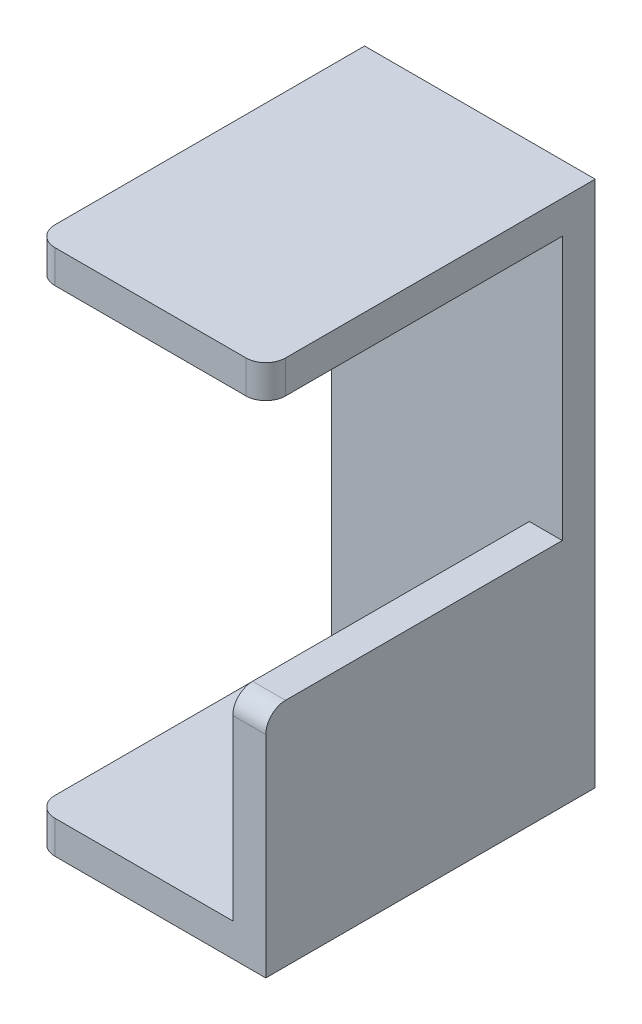
ISO-10303-21;
HEADER;
FILE_DESCRIPTION(('STEP AP214'),'2;1');
FILE_NAME('part.step','',(''),(''),'','','');
FILE_SCHEMA(('AUTOMOTIVE_DESIGN { 1 0 10303 214 1 1 1 1 }'));
ENDSEC;
DATA;
#1=APPLICATION_CONTEXT('core data for automotive mechanical design processes');
#2=APPLICATION_PROTOCOL_DEFINITION('international standard','automotive_design',2000,#1);
#3=PRODUCT_CONTEXT('',#1,'mechanical');
#4=PRODUCT('Part','Part','',(#3));
#5=PRODUCT_RELATED_PRODUCT_CATEGORY('part','',(#4));
#6=PRODUCT_DEFINITION_FORMATION('','',#4);
#7=PRODUCT_DEFINITION_CONTEXT('part definition',#1,'design');
#8=PRODUCT_DEFINITION('design','',#6,#7);
#9=PRODUCT_DEFINITION_SHAPE('','',#8);
#10=(LENGTH_UNIT() NAMED_UNIT(*) SI_UNIT(.MILLI.,.METRE.));
#11=(NAMED_UNIT(*) PLANE_ANGLE_UNIT() SI_UNIT($,.RADIAN.));
#12=(NAMED_UNIT(*) SI_UNIT($,.STERADIAN.) SOLID_ANGLE_UNIT());
#13=UNCERTAINTY_MEASURE_WITH_UNIT(LENGTH_MEASURE(1.E-05),#10,'distance_accuracy_value','');
#14=(GEOMETRIC_REPRESENTATION_CONTEXT(3) GLOBAL_UNCERTAINTY_ASSIGNED_CONTEXT((#13)) GLOBAL_UNIT_ASSIGNED_CONTEXT((#10,
#11,#12)) REPRESENTATION_CONTEXT('',''));
#15=CARTESIAN_POINT('',(0.,0.,0.));
#16=DIRECTION('',(0.,0.,1.));
#17=DIRECTION('',(1.,0.,0.));
#18=AXIS2_PLACEMENT_3D('',#15,#16,#17);
#19=CARTESIAN_POINT('',(0.,0.,5.));
#20=DIRECTION('',(0.,0.,1.));
#21=DIRECTION('',(1.,0.,0.));
#22=AXIS2_PLACEMENT_3D('',#19,#20,#21);
#23=PLANE('',#22);
#24=DIRECTION('',(0.,1.,0.));
#25=VECTOR('',#24,1.);
#26=CARTESIAN_POINT('',(-17.1381771381771,-45.1948051948052,5.));
#27=LINE('',#26,#25);
#28=CARTESIAN_POINT('',(-17.1381771381771,-40.1948051948052,5.));
#29=VERTEX_POINT('',#28);
#30=CARTESIAN_POINT('',(-17.1381771381771,-10.1948051948052,5.));
#31=VERTEX_POINT('',#30);
#32=EDGE_CURVE('E185',#29,#31,#27,.T.);
#33=ORIENTED_EDGE('',*,*,#32,.T.);
#34=DIRECTION('',(-1.,0.,0.));
#35=VECTOR('',#34,1.);
#36=CARTESIAN_POINT('',(-12.1381771381771,-10.1948051948052,5.));
#37=LINE('',#36,#35);
#38=CARTESIAN_POINT('',(-12.1381771381771,-10.1948051948052,5.));
#39=VERTEX_POINT('',#38);
#40=EDGE_CURVE('E199',#39,#31,#37,.T.);
#41=ORIENTED_EDGE('',*,*,#40,.F.);
#42=DIRECTION('',(0.,1.,0.));
#43=VECTOR('',#42,1.);
#44=CARTESIAN_POINT('',(-12.1381771381771,34.8051948051948,5.));
#45=LINE('',#44,#43);
#46=CARTESIAN_POINT('',(-12.1381771381771,29.8051948051948,5.));
#47=VERTEX_POINT('',#46);
#48=EDGE_CURVE('E226',#39,#47,#45,.T.);
#49=ORIENTED_EDGE('',*,*,#48,.T.);
#50=DIRECTION('',(1.,0.,0.));
#51=VECTOR('',#50,1.);
#52=CARTESIAN_POINT('',(-47.1381771381771,29.8051948051948,5.));
#53=LINE('',#52,#51);
#54=CARTESIAN_POINT('',(-47.1381771381771,29.8051948051948,5.));
#55=VERTEX_POINT('',#54);
#56=EDGE_CURVE('E209',#55,#47,#53,.T.);
#57=ORIENTED_EDGE('',*,*,#56,.F.);
#58=DIRECTION('',(0.,-1.,0.));
#59=VECTOR('',#58,1.);
#60=CARTESIAN_POINT('',(-47.1381771381771,34.8051948051948,5.));
#61=LINE('',#60,#59);
#62=CARTESIAN_POINT('',(-47.1381771381771,-40.1948051948052,5.));
#63=VERTEX_POINT('',#62);
#64=EDGE_CURVE('E222',#55,#63,#61,.T.);
#65=ORIENTED_EDGE('',*,*,#64,.T.);
#66=DIRECTION('',(1.,0.,0.));
#67=VECTOR('',#66,1.);
#68=CARTESIAN_POINT('',(-47.1381771381771,-40.1948051948052,5.));
#69=LINE('',#68,#67);
#70=EDGE_CURVE('E177',#63,#29,#69,.T.);
#71=ORIENTED_EDGE('',*,*,#70,.T.);
#72=EDGE_LOOP('',(#33,#41,#49,#57,#65,#71));
#73=FACE_BOUND('',#72,.T.);
#74=ADVANCED_FACE('F63',(#73),#23,.T.);
#75=CARTESIAN_POINT('',(-47.1381771381771,34.8051948051948,5.));
#76=DIRECTION('',(1.,0.,0.));
#77=DIRECTION('',(0.,0.,-1.));
#78=AXIS2_PLACEMENT_3D('',#75,#76,#77);
#79=PLANE('',#78);
#80=DIRECTION('',(0.,0.,-1.));
#81=VECTOR('',#80,1.);
#82=CARTESIAN_POINT('',(-47.1381771381771,-45.1948051948052,5.));
#83=LINE('',#82,#81);
#84=CARTESIAN_POINT('',(-47.1381771381771,-45.1948051948052,47.));
#85=VERTEX_POINT('',#84);
#86=CARTESIAN_POINT('',(-47.1381771381771,-45.1948051948052,0.));
#87=VERTEX_POINT('',#86);
#88=EDGE_CURVE('E254',#85,#87,#83,.T.);
#89=ORIENTED_EDGE('',*,*,#88,.F.);
#90=DIRECTION('',(0.,1.,0.));
#91=VECTOR('',#90,1.);
#92=CARTESIAN_POINT('',(-47.1381771381771,34.8051948051948,47.));
#93=LINE('',#92,#91);
#94=CARTESIAN_POINT('',(-47.1381771381771,-40.1948051948052,47.));
#95=VERTEX_POINT('',#94);
#96=EDGE_CURVE('E260',#85,#95,#93,.T.);
#97=ORIENTED_EDGE('',*,*,#96,.T.);
#98=DIRECTION('',(0.,0.,-1.));
#99=VECTOR('',#98,1.);
#100=CARTESIAN_POINT('',(-47.1381771381771,-40.1948051948052,50.));
#101=LINE('',#100,#99);
#102=EDGE_CURVE('E324',#95,#63,#101,.T.);
#103=ORIENTED_EDGE('',*,*,#102,.T.);
#104=ORIENTED_EDGE('',*,*,#64,.F.);
#105=DIRECTION('',(0.,0.,-1.));
#106=VECTOR('',#105,1.);
#107=CARTESIAN_POINT('',(-47.1381771381771,29.8051948051948,50.));
#108=LINE('',#107,#106);
#109=CARTESIAN_POINT('',(-47.1381771381771,29.8051948051948,47.));
#110=VERTEX_POINT('',#109);
#111=EDGE_CURVE('E212',#110,#55,#108,.T.);
#112=ORIENTED_EDGE('',*,*,#111,.F.);
#113=DIRECTION('',(0.,-1.,0.));
#114=VECTOR('',#113,1.);
#115=CARTESIAN_POINT('',(-47.1381771381771,34.8051948051948,47.));
#116=LINE('',#115,#114);
#117=CARTESIAN_POINT('',(-47.1381771381771,34.8051948051948,47.));
#118=VERTEX_POINT('',#117);
#119=EDGE_CURVE('E257',#110,#118,#116,.F.);
#120=ORIENTED_EDGE('',*,*,#119,.T.);
#121=DIRECTION('',(0.,0.,-1.));
#122=VECTOR('',#121,1.);
#123=CARTESIAN_POINT('',(-47.1381771381771,34.8051948051948,5.));
#124=LINE('',#123,#122);
#125=CARTESIAN_POINT('',(-47.1381771381771,34.8051948051948,0.));
#126=VERTEX_POINT('',#125);
#127=EDGE_CURVE('E231',#118,#126,#124,.T.);
#128=ORIENTED_EDGE('',*,*,#127,.T.);
#129=DIRECTION('',(0.,-1.,0.));
#130=VECTOR('',#129,1.);
#131=CARTESIAN_POINT('',(-47.1381771381771,34.8051948051948,0.));
#132=LINE('',#131,#130);
#133=EDGE_CURVE('E221',#126,#87,#132,.T.);
#134=ORIENTED_EDGE('',*,*,#133,.T.);
#135=EDGE_LOOP('',(#89,#97,#103,#104,#112,#120,#128,#134));
#136=FACE_BOUND('',#135,.T.);
#137=ADVANCED_FACE('F323',(#136),#79,.F.);
#138=CARTESIAN_POINT('',(-47.1381771381771,-45.1948051948052,5.));
#139=DIRECTION('',(0.,1.,0.));
#140=DIRECTION('',(-1.,0.,0.));
#141=AXIS2_PLACEMENT_3D('',#138,#139,#140);
#142=PLANE('',#141);
#143=DIRECTION('',(1.,0.,0.));
#144=VECTOR('',#143,1.);
#145=CARTESIAN_POINT('',(-47.1381771381771,-45.1948051948052,50.));
#146=LINE('',#145,#144);
#147=CARTESIAN_POINT('',(-44.1381771381771,-45.1948051948052,50.));
#148=VERTEX_POINT('',#147);
#149=CARTESIAN_POINT('',(-12.1381771381771,-45.1948051948052,50.));
#150=VERTEX_POINT('',#149);
#151=EDGE_CURVE('E178',#148,#150,#146,.T.);
#152=ORIENTED_EDGE('',*,*,#151,.F.);
#153=CARTESIAN_POINT('',(-44.1381771381771,-45.1948051948052,47.));
#154=DIRECTION('',(0.,1.,0.));
#155=DIRECTION('',(-1.,0.,0.));
#156=AXIS2_PLACEMENT_3D('',#153,#154,#155);
#157=CIRCLE('',#156,3.);
#158=EDGE_CURVE('E271',#148,#85,#157,.F.);
#159=ORIENTED_EDGE('',*,*,#158,.T.);
#160=ORIENTED_EDGE('',*,*,#88,.T.);
#161=DIRECTION('',(1.,0.,0.));
#162=VECTOR('',#161,1.);
#163=CARTESIAN_POINT('',(-47.1381771381771,-45.1948051948052,0.));
#164=LINE('',#163,#162);
#165=CARTESIAN_POINT('',(-12.1381771381771,-45.1948051948052,0.));
#166=VERTEX_POINT('',#165);
#167=EDGE_CURVE('E235',#87,#166,#164,.T.);
#168=ORIENTED_EDGE('',*,*,#167,.T.);
#169=DIRECTION('',(0.,0.,-1.));
#170=VECTOR('',#169,1.);
#171=CARTESIAN_POINT('',(-12.1381771381771,-45.1948051948052,5.));
#172=LINE('',#171,#170);
#173=EDGE_CURVE('E250',#150,#166,#172,.T.);
#174=ORIENTED_EDGE('',*,*,#173,.F.);
#175=EDGE_LOOP('',(#152,#159,#160,#168,#174));
#176=FACE_BOUND('',#175,.T.);
#177=ADVANCED_FACE('F362',(#176),#142,.F.);
#178=CARTESIAN_POINT('',(-12.1381771381771,34.8051948051948,5.));
#179=DIRECTION('',(-1.,0.,0.));
#180=DIRECTION('',(0.,-1.,0.));
#181=AXIS2_PLACEMENT_3D('',#178,#179,#180);
#182=PLANE('',#181);
#183=DIRECTION('',(0.,0.,-1.));
#184=VECTOR('',#183,1.);
#185=CARTESIAN_POINT('',(-12.1381771381771,-10.1948051948052,50.));
#186=LINE('',#185,#184);
#187=CARTESIAN_POINT('',(-12.1381771381771,-10.1948051948052,47.));
#188=VERTEX_POINT('',#187);
#189=EDGE_CURVE('E201',#188,#39,#186,.T.);
#190=ORIENTED_EDGE('',*,*,#189,.F.);
#191=CARTESIAN_POINT('',(-12.1381771381771,-13.1948051948052,47.));
#192=DIRECTION('',(-1.,0.,0.));
#193=DIRECTION('',(0.,-1.,0.));
#194=AXIS2_PLACEMENT_3D('',#191,#192,#193);
#195=CIRCLE('',#194,3.);
#196=CARTESIAN_POINT('',(-12.1381771381771,-13.1948051948052,50.));
#197=VERTEX_POINT('',#196);
#198=EDGE_CURVE('E284',#188,#197,#195,.F.);
#199=ORIENTED_EDGE('',*,*,#198,.T.);
#200=DIRECTION('',(0.,1.,0.));
#201=VECTOR('',#200,1.);
#202=CARTESIAN_POINT('',(-12.1381771381771,-45.1948051948052,50.));
#203=LINE('',#202,#201);
#204=EDGE_CURVE('E195',#150,#197,#203,.T.);
#205=ORIENTED_EDGE('',*,*,#204,.F.);
#206=ORIENTED_EDGE('',*,*,#173,.T.);
#207=DIRECTION('',(0.,1.,0.));
#208=VECTOR('',#207,1.);
#209=CARTESIAN_POINT('',(-12.1381771381771,34.8051948051948,0.));
#210=LINE('',#209,#208);
#211=CARTESIAN_POINT('',(-12.1381771381771,34.8051948051948,0.));
#212=VERTEX_POINT('',#211);
#213=EDGE_CURVE('E238',#166,#212,#210,.T.);
#214=ORIENTED_EDGE('',*,*,#213,.T.);
#215=DIRECTION('',(0.,0.,-1.));
#216=VECTOR('',#215,1.);
#217=CARTESIAN_POINT('',(-12.1381771381771,34.8051948051948,5.));
#218=LINE('',#217,#216);
#219=CARTESIAN_POINT('',(-12.1381771381771,34.8051948051948,47.));
#220=VERTEX_POINT('',#219);
#221=EDGE_CURVE('E247',#220,#212,#218,.T.);
#222=ORIENTED_EDGE('',*,*,#221,.F.);
#223=DIRECTION('',(0.,-1.,0.));
#224=VECTOR('',#223,1.);
#225=CARTESIAN_POINT('',(-12.1381771381771,34.8051948051948,47.));
#226=LINE('',#225,#224);
#227=CARTESIAN_POINT('',(-12.1381771381771,29.8051948051948,47.));
#228=VERTEX_POINT('',#227);
#229=EDGE_CURVE('E280',#220,#228,#226,.T.);
#230=ORIENTED_EDGE('',*,*,#229,.T.);
#231=DIRECTION('',(0.,0.,-1.));
#232=VECTOR('',#231,1.);
#233=CARTESIAN_POINT('',(-12.1381771381771,29.8051948051948,50.));
#234=LINE('',#233,#232);
#235=EDGE_CURVE('E218',#228,#47,#234,.T.);
#236=ORIENTED_EDGE('',*,*,#235,.T.);
#237=ORIENTED_EDGE('',*,*,#48,.F.);
#238=EDGE_LOOP('',(#190,#199,#205,#206,#214,#222,#230,#236,#237));
#239=FACE_BOUND('',#238,.T.);
#240=ADVANCED_FACE('F306',(#239),#182,.F.);
#241=CARTESIAN_POINT('',(-47.1381771381771,34.8051948051948,5.));
#242=DIRECTION('',(0.,-1.,0.));
#243=DIRECTION('',(0.,0.,-1.));
#244=AXIS2_PLACEMENT_3D('',#241,#242,#243);
#245=PLANE('',#244);
#246=ORIENTED_EDGE('',*,*,#127,.F.);
#247=CARTESIAN_POINT('',(-44.1381771381771,34.8051948051948,47.));
#248=DIRECTION('',(0.,-1.,0.));
#249=DIRECTION('',(0.,0.,-1.));
#250=AXIS2_PLACEMENT_3D('',#247,#248,#249);
#251=CIRCLE('',#250,3.);
#252=CARTESIAN_POINT('',(-44.1381771381771,34.8051948051948,50.));
#253=VERTEX_POINT('',#252);
#254=EDGE_CURVE('E12',#118,#253,#251,.F.);
#255=ORIENTED_EDGE('',*,*,#254,.T.);
#256=DIRECTION('',(1.,0.,0.));
#257=VECTOR('',#256,1.);
#258=CARTESIAN_POINT('',(-47.1381771381771,34.8051948051948,50.));
#259=LINE('',#258,#257);
#260=CARTESIAN_POINT('',(-15.1381771381771,34.8051948051948,50.));
#261=VERTEX_POINT('',#260);
#262=EDGE_CURVE('E208',#253,#261,#259,.T.);
#263=ORIENTED_EDGE('',*,*,#262,.T.);
#264=CARTESIAN_POINT('',(-15.1381771381771,34.8051948051948,47.));
#265=DIRECTION('',(0.,-1.,0.));
#266=DIRECTION('',(0.,0.,-1.));
#267=AXIS2_PLACEMENT_3D('',#264,#265,#266);
#268=CIRCLE('',#267,3.);
#269=EDGE_CURVE('E72',#261,#220,#268,.F.);
#270=ORIENTED_EDGE('',*,*,#269,.T.);
#271=ORIENTED_EDGE('',*,*,#221,.T.);
#272=DIRECTION('',(-1.,0.,0.));
#273=VECTOR('',#272,1.);
#274=CARTESIAN_POINT('',(-47.1381771381771,34.8051948051948,0.));
#275=LINE('',#274,#273);
#276=EDGE_CURVE('E227',#212,#126,#275,.T.);
#277=ORIENTED_EDGE('',*,*,#276,.T.);
#278=EDGE_LOOP('',(#246,#255,#263,#270,#271,#277));
#279=FACE_BOUND('',#278,.T.);
#280=ADVANCED_FACE('F301',(#279),#245,.F.);
#281=CARTESIAN_POINT('',(0.,0.,0.));
#282=DIRECTION('',(0.,0.,1.));
#283=DIRECTION('',(1.,0.,0.));
#284=AXIS2_PLACEMENT_3D('',#281,#282,#283);
#285=PLANE('',#284);
#286=ORIENTED_EDGE('',*,*,#133,.F.);
#287=ORIENTED_EDGE('',*,*,#276,.F.);
#288=ORIENTED_EDGE('',*,*,#213,.F.);
#289=ORIENTED_EDGE('',*,*,#167,.F.);
#290=EDGE_LOOP('',(#286,#287,#288,#289));
#291=FACE_BOUND('',#290,.T.);
#292=ADVANCED_FACE('F367',(#291),#285,.F.);
#293=CARTESIAN_POINT('',(-47.1381771381771,29.8051948051948,50.));
#294=DIRECTION('',(0.,1.,0.));
#295=DIRECTION('',(-1.,0.,0.));
#296=AXIS2_PLACEMENT_3D('',#293,#294,#295);
#297=PLANE('',#296);
#298=DIRECTION('',(1.,0.,0.));
#299=VECTOR('',#298,1.);
#300=CARTESIAN_POINT('',(-47.1381771381771,29.8051948051948,50.));
#301=LINE('',#300,#299);
#302=CARTESIAN_POINT('',(-44.1381771381771,29.8051948051948,50.));
#303=VERTEX_POINT('',#302);
#304=CARTESIAN_POINT('',(-15.1381771381771,29.8051948051948,50.));
#305=VERTEX_POINT('',#304);
#306=EDGE_CURVE('E205',#303,#305,#301,.T.);
#307=ORIENTED_EDGE('',*,*,#306,.F.);
#308=CARTESIAN_POINT('',(-44.1381771381771,29.8051948051948,47.));
#309=DIRECTION('',(0.,1.,0.));
#310=DIRECTION('',(-1.,0.,0.));
#311=AXIS2_PLACEMENT_3D('',#308,#309,#310);
#312=CIRCLE('',#311,3.);
#313=EDGE_CURVE('E296',#303,#110,#312,.F.);
#314=ORIENTED_EDGE('',*,*,#313,.T.);
#315=ORIENTED_EDGE('',*,*,#111,.T.);
#316=ORIENTED_EDGE('',*,*,#56,.T.);
#317=ORIENTED_EDGE('',*,*,#235,.F.);
#318=CARTESIAN_POINT('',(-15.1381771381771,29.8051948051948,47.));
#319=DIRECTION('',(0.,1.,0.));
#320=DIRECTION('',(-1.,0.,0.));
#321=AXIS2_PLACEMENT_3D('',#318,#319,#320);
#322=CIRCLE('',#321,3.);
#323=EDGE_CURVE('E293',#228,#305,#322,.F.);
#324=ORIENTED_EDGE('',*,*,#323,.T.);
#325=EDGE_LOOP('',(#307,#314,#315,#316,#317,#324));
#326=FACE_BOUND('',#325,.T.);
#327=ADVANCED_FACE('F312',(#326),#297,.F.);
#328=CARTESIAN_POINT('',(0.,0.,50.));
#329=DIRECTION('',(0.,0.,-1.));
#330=DIRECTION('',(-1.,0.,0.));
#331=AXIS2_PLACEMENT_3D('',#328,#329,#330);
#332=PLANE('',#331);
#333=ORIENTED_EDGE('',*,*,#262,.F.);
#334=DIRECTION('',(0.,-1.,0.));
#335=VECTOR('',#334,1.);
#336=CARTESIAN_POINT('',(-44.1381771381771,0.,50.));
#337=LINE('',#336,#335);
#338=EDGE_CURVE('E289',#253,#303,#337,.T.);
#339=ORIENTED_EDGE('',*,*,#338,.T.);
#340=ORIENTED_EDGE('',*,*,#306,.T.);
#341=DIRECTION('',(0.,-1.,0.));
#342=VECTOR('',#341,1.);
#343=CARTESIAN_POINT('',(-15.1381771381771,0.,50.));
#344=LINE('',#343,#342);
#345=EDGE_CURVE('E79',#305,#261,#344,.F.);
#346=ORIENTED_EDGE('',*,*,#345,.T.);
#347=EDGE_LOOP('',(#333,#339,#340,#346));
#348=FACE_BOUND('',#347,.T.);
#349=ADVANCED_FACE('F313',(#348),#332,.F.);
#350=CARTESIAN_POINT('',(0.,0.,50.));
#351=DIRECTION('',(0.,0.,-1.));
#352=DIRECTION('',(-1.,0.,0.));
#353=AXIS2_PLACEMENT_3D('',#350,#351,#352);
#354=PLANE('',#353);
#355=DIRECTION('',(1.,0.,0.));
#356=VECTOR('',#355,1.);
#357=CARTESIAN_POINT('',(-47.1381771381771,-40.1948051948052,50.));
#358=LINE('',#357,#356);
#359=CARTESIAN_POINT('',(-44.1381771381771,-40.1948051948052,50.));
#360=VERTEX_POINT('',#359);
#361=CARTESIAN_POINT('',(-17.1381771381771,-40.1948051948052,50.));
#362=VERTEX_POINT('',#361);
#363=EDGE_CURVE('E165',#360,#362,#358,.T.);
#364=ORIENTED_EDGE('',*,*,#363,.F.);
#365=DIRECTION('',(0.,1.,0.));
#366=VECTOR('',#365,1.);
#367=CARTESIAN_POINT('',(-44.1381771381771,0.,50.));
#368=LINE('',#367,#366);
#369=EDGE_CURVE('E268',#360,#148,#368,.F.);
#370=ORIENTED_EDGE('',*,*,#369,.T.);
#371=ORIENTED_EDGE('',*,*,#151,.T.);
#372=ORIENTED_EDGE('',*,*,#204,.T.);
#373=DIRECTION('',(-1.,0.,0.));
#374=VECTOR('',#373,1.);
#375=CARTESIAN_POINT('',(0.,-13.1948051948052,50.));
#376=LINE('',#375,#374);
#377=CARTESIAN_POINT('',(-17.1381771381771,-13.1948051948052,50.));
#378=VERTEX_POINT('',#377);
#379=EDGE_CURVE('E193',#197,#378,#376,.T.);
#380=ORIENTED_EDGE('',*,*,#379,.T.);
#381=DIRECTION('',(0.,1.,0.));
#382=VECTOR('',#381,1.);
#383=CARTESIAN_POINT('',(-17.1381771381771,-45.1948051948052,50.));
#384=LINE('',#383,#382);
#385=EDGE_CURVE('E183',#362,#378,#384,.T.);
#386=ORIENTED_EDGE('',*,*,#385,.F.);
#387=EDGE_LOOP('',(#364,#370,#371,#372,#380,#386));
#388=FACE_BOUND('',#387,.T.);
#389=ADVANCED_FACE('F190',(#388),#354,.F.);
#390=CARTESIAN_POINT('',(-12.1381771381771,-10.1948051948052,50.));
#391=DIRECTION('',(0.,-1.,0.));
#392=DIRECTION('',(0.,0.,-1.));
#393=AXIS2_PLACEMENT_3D('',#390,#391,#392);
#394=PLANE('',#393);
#395=DIRECTION('',(0.,0.,-1.));
#396=VECTOR('',#395,1.);
#397=CARTESIAN_POINT('',(-17.1381771381771,-10.1948051948052,50.));
#398=LINE('',#397,#396);
#399=CARTESIAN_POINT('',(-17.1381771381771,-10.1948051948052,47.));
#400=VERTEX_POINT('',#399);
#401=EDGE_CURVE('E187',#400,#31,#398,.T.);
#402=ORIENTED_EDGE('',*,*,#401,.F.);
#403=DIRECTION('',(-1.,0.,0.));
#404=VECTOR('',#403,1.);
#405=CARTESIAN_POINT('',(-12.1381771381771,-10.1948051948052,47.));
#406=LINE('',#405,#404);
#407=EDGE_CURVE('E277',#400,#188,#406,.F.);
#408=ORIENTED_EDGE('',*,*,#407,.T.);
#409=ORIENTED_EDGE('',*,*,#189,.T.);
#410=ORIENTED_EDGE('',*,*,#40,.T.);
#411=EDGE_LOOP('',(#402,#408,#409,#410));
#412=FACE_BOUND('',#411,.T.);
#413=ADVANCED_FACE('F341',(#412),#394,.F.);
#414=CARTESIAN_POINT('',(-17.1381771381771,-45.1948051948052,50.));
#415=DIRECTION('',(-1.,0.,0.));
#416=DIRECTION('',(0.,0.,1.));
#417=AXIS2_PLACEMENT_3D('',#414,#415,#416);
#418=PLANE('',#417);
#419=ORIENTED_EDGE('',*,*,#385,.T.);
#420=CARTESIAN_POINT('',(-17.1381771381771,-13.1948051948052,47.));
#421=DIRECTION('',(-1.,0.,0.));
#422=DIRECTION('',(0.,0.,1.));
#423=AXIS2_PLACEMENT_3D('',#420,#421,#422);
#424=CIRCLE('',#423,3.);
#425=EDGE_CURVE('E274',#378,#400,#424,.T.);
#426=ORIENTED_EDGE('',*,*,#425,.T.);
#427=ORIENTED_EDGE('',*,*,#401,.T.);
#428=ORIENTED_EDGE('',*,*,#32,.F.);
#429=DIRECTION('',(0.,0.,-1.));
#430=VECTOR('',#429,1.);
#431=CARTESIAN_POINT('',(-17.1381771381771,-40.1948051948052,50.));
#432=LINE('',#431,#430);
#433=EDGE_CURVE('E170',#362,#29,#432,.T.);
#434=ORIENTED_EDGE('',*,*,#433,.F.);
#435=EDGE_LOOP('',(#419,#426,#427,#428,#434));
#436=FACE_BOUND('',#435,.T.);
#437=ADVANCED_FACE('F182',(#436),#418,.T.);
#438=CARTESIAN_POINT('',(-47.1381771381771,-40.1948051948052,50.));
#439=DIRECTION('',(0.,1.,0.));
#440=DIRECTION('',(0.,0.,1.));
#441=AXIS2_PLACEMENT_3D('',#438,#439,#440);
#442=PLANE('',#441);
#443=ORIENTED_EDGE('',*,*,#102,.F.);
#444=CARTESIAN_POINT('',(-44.1381771381771,-40.1948051948052,47.));
#445=DIRECTION('',(0.,1.,0.));
#446=DIRECTION('',(0.,0.,1.));
#447=AXIS2_PLACEMENT_3D('',#444,#445,#446);
#448=CIRCLE('',#447,3.);
#449=EDGE_CURVE('E172',#95,#360,#448,.T.);
#450=ORIENTED_EDGE('',*,*,#449,.T.);
#451=ORIENTED_EDGE('',*,*,#363,.T.);
#452=ORIENTED_EDGE('',*,*,#433,.T.);
#453=ORIENTED_EDGE('',*,*,#70,.F.);
#454=EDGE_LOOP('',(#443,#450,#451,#452,#453));
#455=FACE_BOUND('',#454,.T.);
#456=ADVANCED_FACE('F168',(#455),#442,.T.);
#457=CARTESIAN_POINT('',(-44.1381771381771,34.8051948051948,47.));
#458=DIRECTION('',(0.,1.,0.));
#459=DIRECTION('',(0.,0.,1.));
#460=AXIS2_PLACEMENT_3D('',#457,#458,#459);
#461=CYLINDRICAL_SURFACE('',#460,3.);
#462=ORIENTED_EDGE('',*,*,#158,.F.);
#463=ORIENTED_EDGE('',*,*,#369,.F.);
#464=ORIENTED_EDGE('',*,*,#449,.F.);
#465=ORIENTED_EDGE('',*,*,#96,.F.);
#466=EDGE_LOOP('',(#462,#463,#464,#465));
#467=FACE_BOUND('',#466,.T.);
#468=ADVANCED_FACE('F349',(#467),#461,.T.);
#469=CARTESIAN_POINT('',(0.,-13.1948051948052,47.));
#470=DIRECTION('',(-1.,0.,0.));
#471=DIRECTION('',(0.,0.,1.));
#472=AXIS2_PLACEMENT_3D('',#469,#470,#471);
#473=CYLINDRICAL_SURFACE('',#472,3.);
#474=ORIENTED_EDGE('',*,*,#198,.F.);
#475=ORIENTED_EDGE('',*,*,#407,.F.);
#476=ORIENTED_EDGE('',*,*,#425,.F.);
#477=ORIENTED_EDGE('',*,*,#379,.F.);
#478=EDGE_LOOP('',(#474,#475,#476,#477));
#479=FACE_BOUND('',#478,.T.);
#480=ADVANCED_FACE('F347',(#479),#473,.T.);
#481=CARTESIAN_POINT('',(-44.1381771381771,0.,47.));
#482=DIRECTION('',(0.,-1.,0.));
#483=DIRECTION('',(0.,0.,-1.));
#484=AXIS2_PLACEMENT_3D('',#481,#482,#483);
#485=CYLINDRICAL_SURFACE('',#484,3.);
#486=ORIENTED_EDGE('',*,*,#254,.F.);
#487=ORIENTED_EDGE('',*,*,#119,.F.);
#488=ORIENTED_EDGE('',*,*,#313,.F.);
#489=ORIENTED_EDGE('',*,*,#338,.F.);
#490=EDGE_LOOP('',(#486,#487,#488,#489));
#491=FACE_BOUND('',#490,.T.);
#492=ADVANCED_FACE('F316',(#491),#485,.T.);
#493=CARTESIAN_POINT('',(-15.1381771381771,34.8051948051948,47.));
#494=DIRECTION('',(0.,-1.,0.));
#495=DIRECTION('',(1.,0.,0.));
#496=AXIS2_PLACEMENT_3D('',#493,#494,#495);
#497=CYLINDRICAL_SURFACE('',#496,3.);
#498=ORIENTED_EDGE('',*,*,#269,.F.);
#499=ORIENTED_EDGE('',*,*,#345,.F.);
#500=ORIENTED_EDGE('',*,*,#323,.F.);
#501=ORIENTED_EDGE('',*,*,#229,.F.);
#502=EDGE_LOOP('',(#498,#499,#500,#501));
#503=FACE_BOUND('',#502,.T.);
#504=ADVANCED_FACE('F65',(#503),#497,.T.);
#505=CLOSED_SHELL('',(#74,#137,#177,#240,#280,#292,#327,#349,#389,#413,#437,#456,#468,#480,#492,#504));
#506=MANIFOLD_SOLID_BREP('B2',#505);
#507=ADVANCED_BREP_SHAPE_REPRESENTATION('',(#18,#506),#14);
#508=SHAPE_DEFINITION_REPRESENTATION(#9,#507);
ENDSEC;
END-ISO-10303-21;
